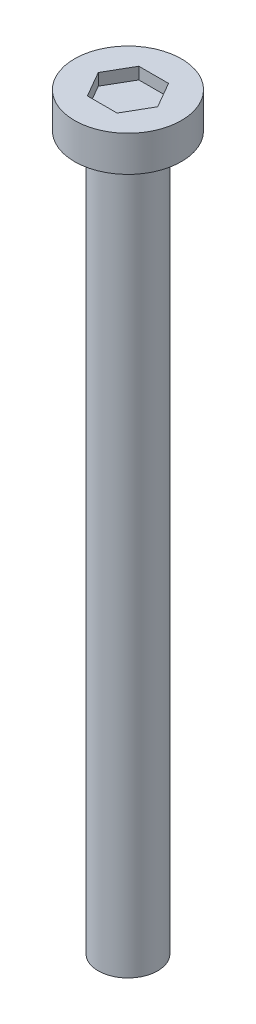
ISO-10303-21;
HEADER;
FILE_DESCRIPTION(('STEP AP214'),'2;1');
FILE_NAME('part.step','',(''),(''),'','','');
FILE_SCHEMA(('AUTOMOTIVE_DESIGN { 1 0 10303 214 1 1 1 1 }'));
ENDSEC;
DATA;
#1=APPLICATION_CONTEXT('core data for automotive mechanical design processes');
#2=APPLICATION_PROTOCOL_DEFINITION('international standard','automotive_design',2000,#1);
#3=PRODUCT_CONTEXT('',#1,'mechanical');
#4=PRODUCT('Part','Part','',(#3));
#5=PRODUCT_RELATED_PRODUCT_CATEGORY('part','',(#4));
#6=PRODUCT_DEFINITION_FORMATION('','',#4);
#7=PRODUCT_DEFINITION_CONTEXT('part definition',#1,'design');
#8=PRODUCT_DEFINITION('design','',#6,#7);
#9=PRODUCT_DEFINITION_SHAPE('','',#8);
#10=(LENGTH_UNIT() NAMED_UNIT(*) SI_UNIT(.MILLI.,.METRE.));
#11=(NAMED_UNIT(*) PLANE_ANGLE_UNIT() SI_UNIT($,.RADIAN.));
#12=(NAMED_UNIT(*) SI_UNIT($,.STERADIAN.) SOLID_ANGLE_UNIT());
#13=UNCERTAINTY_MEASURE_WITH_UNIT(LENGTH_MEASURE(1.E-05),#10,'distance_accuracy_value','');
#14=(GEOMETRIC_REPRESENTATION_CONTEXT(3) GLOBAL_UNCERTAINTY_ASSIGNED_CONTEXT((#13)) GLOBAL_UNIT_ASSIGNED_CONTEXT((#10,
#11,#12)) REPRESENTATION_CONTEXT('',''));
#15=CARTESIAN_POINT('',(0.,0.,0.));
#16=DIRECTION('',(0.,0.,1.));
#17=DIRECTION('',(1.,0.,0.));
#18=AXIS2_PLACEMENT_3D('',#15,#16,#17);
#19=CARTESIAN_POINT('',(0.,30.,0.));
#20=DIRECTION('',(0.,-1.,0.));
#21=DIRECTION('',(0.,0.,-1.));
#22=AXIS2_PLACEMENT_3D('',#19,#20,#21);
#23=CYLINDRICAL_SURFACE('',#22,1.25);
#24=CARTESIAN_POINT('',(0.,30.,0.));
#25=DIRECTION('',(0.,1.,0.));
#26=DIRECTION('',(0.,0.,1.));
#27=AXIS2_PLACEMENT_3D('',#24,#25,#26);
#28=CIRCLE('',#27,1.25);
#29=CARTESIAN_POINT('',(0.,30.,1.25));
#30=VERTEX_POINT('',#29);
#31=EDGE_CURVE('E11',#30,#30,#28,.T.);
#32=ORIENTED_EDGE('',*,*,#31,.F.);
#33=EDGE_LOOP('',(#32));
#34=FACE_BOUND('',#33,.T.);
#35=CARTESIAN_POINT('',(0.,0.,0.));
#36=DIRECTION('',(0.,1.,0.));
#37=DIRECTION('',(0.,0.,1.));
#38=AXIS2_PLACEMENT_3D('',#35,#36,#37);
#39=CIRCLE('',#38,1.25);
#40=CARTESIAN_POINT('',(0.,0.,1.25));
#41=VERTEX_POINT('',#40);
#42=EDGE_CURVE('E42',#41,#41,#39,.T.);
#43=ORIENTED_EDGE('',*,*,#42,.T.);
#44=EDGE_LOOP('',(#43));
#45=FACE_BOUND('',#44,.T.);
#46=ADVANCED_FACE('F39',(#34,#45),#23,.T.);
#47=CARTESIAN_POINT('',(0.,0.,0.));
#48=DIRECTION('',(0.,1.,0.));
#49=DIRECTION('',(0.,0.,1.));
#50=AXIS2_PLACEMENT_3D('',#47,#48,#49);
#51=PLANE('',#50);
#52=ORIENTED_EDGE('',*,*,#42,.F.);
#53=EDGE_LOOP('',(#52));
#54=FACE_BOUND('',#53,.T.);
#55=ADVANCED_FACE('F189',(#54),#51,.F.);
#56=CARTESIAN_POINT('',(0.,31.5,0.));
#57=DIRECTION('',(0.,-1.,0.));
#58=DIRECTION('',(0.,0.,-1.));
#59=AXIS2_PLACEMENT_3D('',#56,#57,#58);
#60=CYLINDRICAL_SURFACE('',#59,2.25);
#61=CARTESIAN_POINT('',(0.,31.5,0.));
#62=DIRECTION('',(0.,1.,0.));
#63=DIRECTION('',(0.,0.,1.));
#64=AXIS2_PLACEMENT_3D('',#61,#62,#63);
#65=CIRCLE('',#64,2.25);
#66=CARTESIAN_POINT('',(0.,31.5,2.25));
#67=VERTEX_POINT('',#66);
#68=EDGE_CURVE('E163',#67,#67,#65,.T.);
#69=ORIENTED_EDGE('',*,*,#68,.F.);
#70=EDGE_LOOP('',(#69));
#71=FACE_BOUND('',#70,.T.);
#72=CARTESIAN_POINT('',(0.,30.,0.));
#73=DIRECTION('',(0.,1.,0.));
#74=DIRECTION('',(0.,0.,1.));
#75=AXIS2_PLACEMENT_3D('',#72,#73,#74);
#76=CIRCLE('',#75,2.25);
#77=CARTESIAN_POINT('',(0.,30.,2.25));
#78=VERTEX_POINT('',#77);
#79=EDGE_CURVE('E153',#78,#78,#76,.T.);
#80=ORIENTED_EDGE('',*,*,#79,.T.);
#81=EDGE_LOOP('',(#80));
#82=FACE_BOUND('',#81,.T.);
#83=ADVANCED_FACE('F171',(#71,#82),#60,.T.);
#84=CARTESIAN_POINT('',(0.,31.5,0.));
#85=DIRECTION('',(0.,1.,0.));
#86=DIRECTION('',(0.,0.,1.));
#87=AXIS2_PLACEMENT_3D('',#84,#85,#86);
#88=PLANE('',#87);
#89=DIRECTION('',(0.5,0.,-0.866025403784439));
#90=VECTOR('',#89,1.);
#91=CARTESIAN_POINT('',(0.625,31.5,1.08253175473055));
#92=LINE('',#91,#90);
#93=CARTESIAN_POINT('',(0.625,31.5,1.08253175473055));
#94=VERTEX_POINT('',#93);
#95=CARTESIAN_POINT('',(1.25,31.5,0.));
#96=VERTEX_POINT('',#95);
#97=EDGE_CURVE('E54',#94,#96,#92,.T.);
#98=ORIENTED_EDGE('',*,*,#97,.F.);
#99=DIRECTION('',(1.,0.,0.));
#100=VECTOR('',#99,1.);
#101=CARTESIAN_POINT('',(-0.625,31.5,1.08253175473055));
#102=LINE('',#101,#100);
#103=CARTESIAN_POINT('',(-0.625,31.5,1.08253175473055));
#104=VERTEX_POINT('',#103);
#105=EDGE_CURVE('E147',#104,#94,#102,.T.);
#106=ORIENTED_EDGE('',*,*,#105,.F.);
#107=DIRECTION('',(0.5,0.,0.866025403784439));
#108=VECTOR('',#107,1.);
#109=CARTESIAN_POINT('',(-1.25,31.5,0.));
#110=LINE('',#109,#108);
#111=CARTESIAN_POINT('',(-1.25,31.5,0.));
#112=VERTEX_POINT('',#111);
#113=EDGE_CURVE('E144',#112,#104,#110,.T.);
#114=ORIENTED_EDGE('',*,*,#113,.F.);
#115=DIRECTION('',(-0.5,0.,0.866025403784439));
#116=VECTOR('',#115,1.);
#117=CARTESIAN_POINT('',(-0.625,31.5,-1.08253175473055));
#118=LINE('',#117,#116);
#119=CARTESIAN_POINT('',(-0.625,31.5,-1.08253175473055));
#120=VERTEX_POINT('',#119);
#121=EDGE_CURVE('E102',#120,#112,#118,.T.);
#122=ORIENTED_EDGE('',*,*,#121,.F.);
#123=DIRECTION('',(-1.,0.,0.));
#124=VECTOR('',#123,1.);
#125=CARTESIAN_POINT('',(0.625,31.5,-1.08253175473055));
#126=LINE('',#125,#124);
#127=CARTESIAN_POINT('',(0.625,31.5,-1.08253175473055));
#128=VERTEX_POINT('',#127);
#129=EDGE_CURVE('E138',#128,#120,#126,.T.);
#130=ORIENTED_EDGE('',*,*,#129,.F.);
#131=DIRECTION('',(-0.5,0.,-0.866025403784439));
#132=VECTOR('',#131,1.);
#133=CARTESIAN_POINT('',(1.25,31.5,0.));
#134=LINE('',#133,#132);
#135=EDGE_CURVE('E134',#96,#128,#134,.T.);
#136=ORIENTED_EDGE('',*,*,#135,.F.);
#137=EDGE_LOOP('',(#98,#106,#114,#122,#130,#136));
#138=FACE_BOUND('',#137,.T.);
#139=ORIENTED_EDGE('',*,*,#68,.T.);
#140=EDGE_LOOP('',(#139));
#141=FACE_BOUND('',#140,.T.);
#142=ADVANCED_FACE('F176',(#138,#141),#88,.T.);
#143=CARTESIAN_POINT('',(0.,30.,0.));
#144=DIRECTION('',(0.,1.,0.));
#145=DIRECTION('',(0.,0.,1.));
#146=AXIS2_PLACEMENT_3D('',#143,#144,#145);
#147=PLANE('',#146);
#148=ORIENTED_EDGE('',*,*,#31,.T.);
#149=EDGE_LOOP('',(#148));
#150=FACE_BOUND('',#149,.T.);
#151=ORIENTED_EDGE('',*,*,#79,.F.);
#152=EDGE_LOOP('',(#151));
#153=FACE_BOUND('',#152,.T.);
#154=ADVANCED_FACE('F173',(#150,#153),#147,.F.);
#155=CARTESIAN_POINT('',(0.625,31.,1.08253175473055));
#156=DIRECTION('',(0.866025403784439,0.,0.5));
#157=DIRECTION('',(0.5,0.,-0.866025403784439));
#158=AXIS2_PLACEMENT_3D('',#155,#156,#157);
#159=PLANE('',#158);
#160=ORIENTED_EDGE('',*,*,#97,.T.);
#161=DIRECTION('',(0.,1.,0.));
#162=VECTOR('',#161,1.);
#163=CARTESIAN_POINT('',(1.25,31.,0.));
#164=LINE('',#163,#162);
#165=CARTESIAN_POINT('',(1.25,31.,0.));
#166=VERTEX_POINT('',#165);
#167=EDGE_CURVE('E84',#166,#96,#164,.T.);
#168=ORIENTED_EDGE('',*,*,#167,.F.);
#169=DIRECTION('',(0.5,0.,-0.866025403784439));
#170=VECTOR('',#169,1.);
#171=CARTESIAN_POINT('',(0.625,31.,1.08253175473055));
#172=LINE('',#171,#170);
#173=CARTESIAN_POINT('',(0.625,31.,1.08253175473055));
#174=VERTEX_POINT('',#173);
#175=EDGE_CURVE('E150',#174,#166,#172,.T.);
#176=ORIENTED_EDGE('',*,*,#175,.F.);
#177=DIRECTION('',(0.,1.,0.));
#178=VECTOR('',#177,1.);
#179=CARTESIAN_POINT('',(0.625,31.,1.08253175473055));
#180=LINE('',#179,#178);
#181=EDGE_CURVE('E62',#174,#94,#180,.T.);
#182=ORIENTED_EDGE('',*,*,#181,.T.);
#183=EDGE_LOOP('',(#160,#168,#176,#182));
#184=FACE_BOUND('',#183,.T.);
#185=ADVANCED_FACE('F175',(#184),#159,.F.);
#186=CARTESIAN_POINT('',(-0.625,31.,1.08253175473055));
#187=DIRECTION('',(0.,0.,1.));
#188=DIRECTION('',(1.,0.,0.));
#189=AXIS2_PLACEMENT_3D('',#186,#187,#188);
#190=PLANE('',#189);
#191=ORIENTED_EDGE('',*,*,#105,.T.);
#192=ORIENTED_EDGE('',*,*,#181,.F.);
#193=DIRECTION('',(1.,0.,0.));
#194=VECTOR('',#193,1.);
#195=CARTESIAN_POINT('',(-0.625,31.,1.08253175473055));
#196=LINE('',#195,#194);
#197=CARTESIAN_POINT('',(-0.625,31.,1.08253175473055));
#198=VERTEX_POINT('',#197);
#199=EDGE_CURVE('E116',#198,#174,#196,.T.);
#200=ORIENTED_EDGE('',*,*,#199,.F.);
#201=DIRECTION('',(0.,1.,0.));
#202=VECTOR('',#201,1.);
#203=CARTESIAN_POINT('',(-0.625,31.,1.08253175473055));
#204=LINE('',#203,#202);
#205=EDGE_CURVE('E107',#198,#104,#204,.T.);
#206=ORIENTED_EDGE('',*,*,#205,.T.);
#207=EDGE_LOOP('',(#191,#192,#200,#206));
#208=FACE_BOUND('',#207,.T.);
#209=ADVANCED_FACE('F183',(#208),#190,.F.);
#210=CARTESIAN_POINT('',(-1.25,31.,0.));
#211=DIRECTION('',(-0.866025403784439,0.,0.5));
#212=DIRECTION('',(0.5,0.,0.866025403784439));
#213=AXIS2_PLACEMENT_3D('',#210,#211,#212);
#214=PLANE('',#213);
#215=ORIENTED_EDGE('',*,*,#113,.T.);
#216=ORIENTED_EDGE('',*,*,#205,.F.);
#217=DIRECTION('',(0.5,0.,0.866025403784439));
#218=VECTOR('',#217,1.);
#219=CARTESIAN_POINT('',(-1.25,31.,0.));
#220=LINE('',#219,#218);
#221=CARTESIAN_POINT('',(-1.25,31.,0.));
#222=VERTEX_POINT('',#221);
#223=EDGE_CURVE('E111',#222,#198,#220,.T.);
#224=ORIENTED_EDGE('',*,*,#223,.F.);
#225=DIRECTION('',(0.,1.,0.));
#226=VECTOR('',#225,1.);
#227=CARTESIAN_POINT('',(-1.25,31.,0.));
#228=LINE('',#227,#226);
#229=EDGE_CURVE('E95',#222,#112,#228,.T.);
#230=ORIENTED_EDGE('',*,*,#229,.T.);
#231=EDGE_LOOP('',(#215,#216,#224,#230));
#232=FACE_BOUND('',#231,.T.);
#233=ADVANCED_FACE('F112',(#232),#214,.F.);
#234=CARTESIAN_POINT('',(-0.625,31.,-1.08253175473055));
#235=DIRECTION('',(-0.866025403784439,0.,-0.5));
#236=DIRECTION('',(-0.5,0.,0.866025403784439));
#237=AXIS2_PLACEMENT_3D('',#234,#235,#236);
#238=PLANE('',#237);
#239=ORIENTED_EDGE('',*,*,#121,.T.);
#240=ORIENTED_EDGE('',*,*,#229,.F.);
#241=DIRECTION('',(-0.5,0.,0.866025403784439));
#242=VECTOR('',#241,1.);
#243=CARTESIAN_POINT('',(-0.625,31.,-1.08253175473055));
#244=LINE('',#243,#242);
#245=CARTESIAN_POINT('',(-0.625,31.,-1.08253175473055));
#246=VERTEX_POINT('',#245);
#247=EDGE_CURVE('E99',#246,#222,#244,.T.);
#248=ORIENTED_EDGE('',*,*,#247,.F.);
#249=DIRECTION('',(0.,1.,0.));
#250=VECTOR('',#249,1.);
#251=CARTESIAN_POINT('',(-0.625,31.,-1.08253175473055));
#252=LINE('',#251,#250);
#253=EDGE_CURVE('E108',#246,#120,#252,.T.);
#254=ORIENTED_EDGE('',*,*,#253,.T.);
#255=EDGE_LOOP('',(#239,#240,#248,#254));
#256=FACE_BOUND('',#255,.T.);
#257=ADVANCED_FACE('F97',(#256),#238,.F.);
#258=CARTESIAN_POINT('',(0.625,31.,-1.08253175473055));
#259=DIRECTION('',(0.,0.,-1.));
#260=DIRECTION('',(-1.,0.,0.));
#261=AXIS2_PLACEMENT_3D('',#258,#259,#260);
#262=PLANE('',#261);
#263=ORIENTED_EDGE('',*,*,#129,.T.);
#264=ORIENTED_EDGE('',*,*,#253,.F.);
#265=DIRECTION('',(-1.,0.,0.));
#266=VECTOR('',#265,1.);
#267=CARTESIAN_POINT('',(0.625,31.,-1.08253175473055));
#268=LINE('',#267,#266);
#269=CARTESIAN_POINT('',(0.625,31.,-1.08253175473055));
#270=VERTEX_POINT('',#269);
#271=EDGE_CURVE('E122',#270,#246,#268,.T.);
#272=ORIENTED_EDGE('',*,*,#271,.F.);
#273=DIRECTION('',(0.,1.,0.));
#274=VECTOR('',#273,1.);
#275=CARTESIAN_POINT('',(0.625,31.,-1.08253175473055));
#276=LINE('',#275,#274);
#277=EDGE_CURVE('E158',#270,#128,#276,.T.);
#278=ORIENTED_EDGE('',*,*,#277,.T.);
#279=EDGE_LOOP('',(#263,#264,#272,#278));
#280=FACE_BOUND('',#279,.T.);
#281=ADVANCED_FACE('F245',(#280),#262,.F.);
#282=CARTESIAN_POINT('',(1.25,31.,0.));
#283=DIRECTION('',(0.866025403784439,0.,-0.5));
#284=DIRECTION('',(-0.5,0.,-0.866025403784439));
#285=AXIS2_PLACEMENT_3D('',#282,#283,#284);
#286=PLANE('',#285);
#287=ORIENTED_EDGE('',*,*,#135,.T.);
#288=ORIENTED_EDGE('',*,*,#277,.F.);
#289=DIRECTION('',(-0.5,0.,-0.866025403784439));
#290=VECTOR('',#289,1.);
#291=CARTESIAN_POINT('',(1.25,31.,0.));
#292=LINE('',#291,#290);
#293=EDGE_CURVE('E126',#166,#270,#292,.T.);
#294=ORIENTED_EDGE('',*,*,#293,.F.);
#295=ORIENTED_EDGE('',*,*,#167,.T.);
#296=EDGE_LOOP('',(#287,#288,#294,#295));
#297=FACE_BOUND('',#296,.T.);
#298=ADVANCED_FACE('F254',(#297),#286,.F.);
#299=CARTESIAN_POINT('',(0.,31.,0.));
#300=DIRECTION('',(0.,1.,0.));
#301=DIRECTION('',(0.,0.,1.));
#302=AXIS2_PLACEMENT_3D('',#299,#300,#301);
#303=PLANE('',#302);
#304=ORIENTED_EDGE('',*,*,#175,.T.);
#305=ORIENTED_EDGE('',*,*,#293,.T.);
#306=ORIENTED_EDGE('',*,*,#271,.T.);
#307=ORIENTED_EDGE('',*,*,#247,.T.);
#308=ORIENTED_EDGE('',*,*,#223,.T.);
#309=ORIENTED_EDGE('',*,*,#199,.T.);
#310=EDGE_LOOP('',(#304,#305,#306,#307,#308,#309));
#311=FACE_BOUND('',#310,.T.);
#312=ADVANCED_FACE('F119',(#311),#303,.T.);
#313=CLOSED_SHELL('',(#46,#55,#83,#142,#154,#185,#209,#233,#257,#281,#298,#312));
#314=MANIFOLD_SOLID_BREP('B2',#313);
#315=ADVANCED_BREP_SHAPE_REPRESENTATION('',(#18,#314),#14);
#316=SHAPE_DEFINITION_REPRESENTATION(#9,#315);
ENDSEC;
END-ISO-10303-21;
